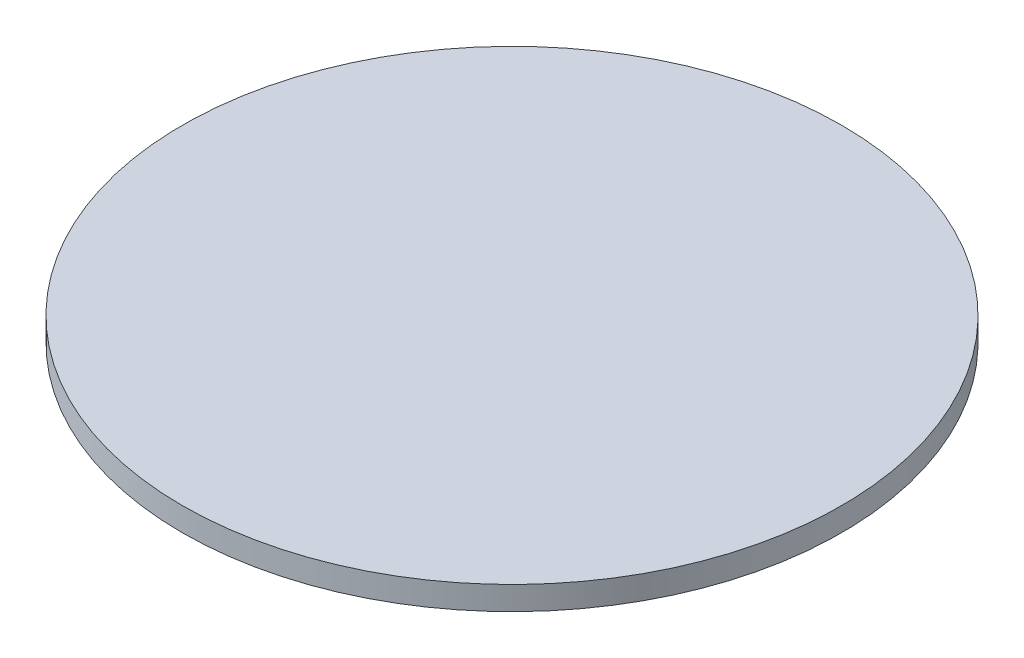
ISO-10303-21;
HEADER;
FILE_DESCRIPTION(('STEP AP214'),'2;1');
FILE_NAME('part.step','',(''),(''),'','','');
FILE_SCHEMA(('AUTOMOTIVE_DESIGN { 1 0 10303 214 1 1 1 1 }'));
ENDSEC;
DATA;
#1=APPLICATION_CONTEXT('core data for automotive mechanical design processes');
#2=APPLICATION_PROTOCOL_DEFINITION('international standard','automotive_design',2000,#1);
#3=PRODUCT_CONTEXT('',#1,'mechanical');
#4=PRODUCT('Part','Part','',(#3));
#5=PRODUCT_RELATED_PRODUCT_CATEGORY('part','',(#4));
#6=PRODUCT_DEFINITION_FORMATION('','',#4);
#7=PRODUCT_DEFINITION_CONTEXT('part definition',#1,'design');
#8=PRODUCT_DEFINITION('design','',#6,#7);
#9=PRODUCT_DEFINITION_SHAPE('','',#8);
#10=(LENGTH_UNIT() NAMED_UNIT(*) SI_UNIT(.MILLI.,.METRE.));
#11=(NAMED_UNIT(*) PLANE_ANGLE_UNIT() SI_UNIT($,.RADIAN.));
#12=(NAMED_UNIT(*) SI_UNIT($,.STERADIAN.) SOLID_ANGLE_UNIT());
#13=UNCERTAINTY_MEASURE_WITH_UNIT(LENGTH_MEASURE(1.E-05),#10,'distance_accuracy_value','');
#14=(GEOMETRIC_REPRESENTATION_CONTEXT(3) GLOBAL_UNCERTAINTY_ASSIGNED_CONTEXT((#13)) GLOBAL_UNIT_ASSIGNED_CONTEXT((#10,
#11,#12)) REPRESENTATION_CONTEXT('',''));
#15=CARTESIAN_POINT('',(0.,0.,0.));
#16=DIRECTION('',(0.,0.,1.));
#17=DIRECTION('',(1.,0.,0.));
#18=AXIS2_PLACEMENT_3D('',#15,#16,#17);
#19=CARTESIAN_POINT('',(0.,100.,0.));
#20=DIRECTION('',(0.,-1.,0.));
#21=DIRECTION('',(0.,0.,-1.));
#22=AXIS2_PLACEMENT_3D('',#19,#20,#21);
#23=CYLINDRICAL_SURFACE('',#22,1400.);
#24=CARTESIAN_POINT('',(0.,100.,0.));
#25=DIRECTION('',(0.,1.,0.));
#26=DIRECTION('',(0.,0.,1.));
#27=AXIS2_PLACEMENT_3D('',#24,#25,#26);
#28=CIRCLE('',#27,1400.);
#29=CARTESIAN_POINT('',(0.,100.,1400.));
#30=VERTEX_POINT('',#29);
#31=EDGE_CURVE('E10',#30,#30,#28,.T.);
#32=ORIENTED_EDGE('',*,*,#31,.F.);
#33=EDGE_LOOP('',(#32));
#34=FACE_BOUND('',#33,.T.);
#35=CARTESIAN_POINT('',(0.,0.,0.));
#36=DIRECTION('',(0.,1.,0.));
#37=DIRECTION('',(0.,0.,1.));
#38=AXIS2_PLACEMENT_3D('',#35,#36,#37);
#39=CIRCLE('',#38,1400.);
#40=CARTESIAN_POINT('',(0.,0.,1400.));
#41=VERTEX_POINT('',#40);
#42=EDGE_CURVE('E34',#41,#41,#39,.T.);
#43=ORIENTED_EDGE('',*,*,#42,.T.);
#44=EDGE_LOOP('',(#43));
#45=FACE_BOUND('',#44,.T.);
#46=ADVANCED_FACE('F31',(#34,#45),#23,.T.);
#47=CARTESIAN_POINT('',(0.,100.,0.));
#48=DIRECTION('',(0.,1.,0.));
#49=DIRECTION('',(0.,0.,1.));
#50=AXIS2_PLACEMENT_3D('',#47,#48,#49);
#51=PLANE('',#50);
#52=ORIENTED_EDGE('',*,*,#31,.T.);
#53=EDGE_LOOP('',(#52));
#54=FACE_BOUND('',#53,.T.);
#55=ADVANCED_FACE('F46',(#54),#51,.T.);
#56=CARTESIAN_POINT('',(0.,0.,0.));
#57=DIRECTION('',(0.,1.,0.));
#58=DIRECTION('',(0.,0.,1.));
#59=AXIS2_PLACEMENT_3D('',#56,#57,#58);
#60=PLANE('',#59);
#61=ORIENTED_EDGE('',*,*,#42,.F.);
#62=EDGE_LOOP('',(#61));
#63=FACE_BOUND('',#62,.T.);
#64=ADVANCED_FACE('F44',(#63),#60,.F.);
#65=CLOSED_SHELL('',(#46,#55,#64));
#66=MANIFOLD_SOLID_BREP('B2',#65);
#67=ADVANCED_BREP_SHAPE_REPRESENTATION('',(#18,#66),#14);
#68=SHAPE_DEFINITION_REPRESENTATION(#9,#67);
ENDSEC;
END-ISO-10303-21;
